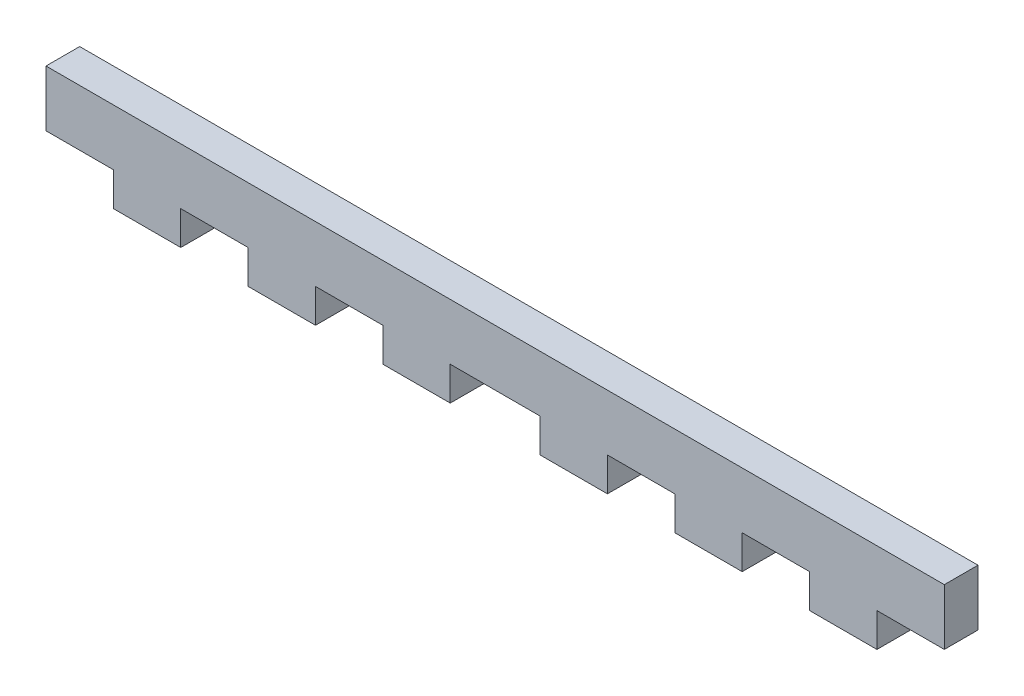
ISO-10303-21;
HEADER;
FILE_DESCRIPTION(('STEP AP214'),'2;1');
FILE_NAME('part.step','',(''),(''),'','','');
FILE_SCHEMA(('AUTOMOTIVE_DESIGN { 1 0 10303 214 1 1 1 1 }'));
ENDSEC;
DATA;
#1=APPLICATION_CONTEXT('core data for automotive mechanical design processes');
#2=APPLICATION_PROTOCOL_DEFINITION('international standard','automotive_design',2000,#1);
#3=PRODUCT_CONTEXT('',#1,'mechanical');
#4=PRODUCT('Part','Part','',(#3));
#5=PRODUCT_RELATED_PRODUCT_CATEGORY('part','',(#4));
#6=PRODUCT_DEFINITION_FORMATION('','',#4);
#7=PRODUCT_DEFINITION_CONTEXT('part definition',#1,'design');
#8=PRODUCT_DEFINITION('design','',#6,#7);
#9=PRODUCT_DEFINITION_SHAPE('','',#8);
#10=(LENGTH_UNIT() NAMED_UNIT(*) SI_UNIT(.MILLI.,.METRE.));
#11=(NAMED_UNIT(*) PLANE_ANGLE_UNIT() SI_UNIT($,.RADIAN.));
#12=(NAMED_UNIT(*) SI_UNIT($,.STERADIAN.) SOLID_ANGLE_UNIT());
#13=UNCERTAINTY_MEASURE_WITH_UNIT(LENGTH_MEASURE(1.E-05),#10,'distance_accuracy_value','');
#14=(GEOMETRIC_REPRESENTATION_CONTEXT(3) GLOBAL_UNCERTAINTY_ASSIGNED_CONTEXT((#13)) GLOBAL_UNIT_ASSIGNED_CONTEXT((#10,
#11,#12)) REPRESENTATION_CONTEXT('',''));
#15=CARTESIAN_POINT('',(0.,0.,0.));
#16=DIRECTION('',(0.,0.,1.));
#17=DIRECTION('',(1.,0.,0.));
#18=AXIS2_PLACEMENT_3D('',#15,#16,#17);
#19=CARTESIAN_POINT('',(-33.3200921356,-10.7316898359705,3.));
#20=DIRECTION('',(0.,1.,0.));
#21=DIRECTION('',(0.,0.,1.));
#22=AXIS2_PLACEMENT_3D('',#19,#20,#21);
#23=PLANE('',#22);
#24=DIRECTION('',(0.,0.,1.));
#25=VECTOR('',#24,1.);
#26=CARTESIAN_POINT('',(40.6799078644,-10.7316898359705,0.));
#27=LINE('',#26,#25);
#28=CARTESIAN_POINT('',(40.6799078644,-10.7316898359705,0.));
#29=VERTEX_POINT('',#28);
#30=CARTESIAN_POINT('',(40.6799078644,-10.7316898359705,3.));
#31=VERTEX_POINT('',#30);
#32=EDGE_CURVE('E332',#29,#31,#27,.T.);
#33=ORIENTED_EDGE('',*,*,#32,.F.);
#34=DIRECTION('',(1.,0.,0.));
#35=VECTOR('',#34,1.);
#36=CARTESIAN_POINT('',(-33.3200921356,-10.7316898359705,0.));
#37=LINE('',#36,#35);
#38=CARTESIAN_POINT('',(46.6799078644,-10.7316898359705,0.));
#39=VERTEX_POINT('',#38);
#40=EDGE_CURVE('E259',#29,#39,#37,.T.);
#41=ORIENTED_EDGE('',*,*,#40,.T.);
#42=DIRECTION('',(0.,0.,-1.));
#43=VECTOR('',#42,1.);
#44=CARTESIAN_POINT('',(46.6799078644,-10.7316898359705,3.));
#45=LINE('',#44,#43);
#46=CARTESIAN_POINT('',(46.6799078644,-10.7316898359705,3.));
#47=VERTEX_POINT('',#46);
#48=EDGE_CURVE('E54',#47,#39,#45,.T.);
#49=ORIENTED_EDGE('',*,*,#48,.F.);
#50=DIRECTION('',(1.,0.,0.));
#51=VECTOR('',#50,1.);
#52=CARTESIAN_POINT('',(-33.3200921356,-10.7316898359705,3.));
#53=LINE('',#52,#51);
#54=EDGE_CURVE('E313',#31,#47,#53,.T.);
#55=ORIENTED_EDGE('',*,*,#54,.F.);
#56=EDGE_LOOP('',(#33,#41,#49,#55));
#57=FACE_BOUND('',#56,.T.);
#58=ADVANCED_FACE('F45',(#57),#23,.F.);
#59=CARTESIAN_POINT('',(28.6799078644001,-10.7316898359705,0.));
#60=VERTEX_POINT('',#59);
#61=CARTESIAN_POINT('',(34.6799078644001,-10.7316898359705,0.));
#62=VERTEX_POINT('',#61);
#63=EDGE_CURVE('E247',#60,#62,#37,.T.);
#64=ORIENTED_EDGE('',*,*,#63,.T.);
#65=DIRECTION('',(0.,0.,1.));
#66=VECTOR('',#65,1.);
#67=CARTESIAN_POINT('',(34.6799078644001,-10.7316898359705,0.));
#68=LINE('',#67,#66);
#69=CARTESIAN_POINT('',(34.6799078644001,-10.7316898359705,3.));
#70=VERTEX_POINT('',#69);
#71=EDGE_CURVE('E229',#62,#70,#68,.T.);
#72=ORIENTED_EDGE('',*,*,#71,.T.);
#73=CARTESIAN_POINT('',(28.6799078644001,-10.7316898359705,3.));
#74=VERTEX_POINT('',#73);
#75=EDGE_CURVE('E316',#74,#70,#53,.T.);
#76=ORIENTED_EDGE('',*,*,#75,.F.);
#77=DIRECTION('',(0.,0.,1.));
#78=VECTOR('',#77,1.);
#79=CARTESIAN_POINT('',(28.6799078644001,-10.7316898359705,0.));
#80=LINE('',#79,#78);
#81=EDGE_CURVE('E256',#60,#74,#80,.T.);
#82=ORIENTED_EDGE('',*,*,#81,.F.);
#83=EDGE_LOOP('',(#64,#72,#76,#82));
#84=FACE_BOUND('',#83,.T.);
#85=ADVANCED_FACE('F255',(#84),#23,.F.);
#86=CARTESIAN_POINT('',(16.6799078644,-10.7316898359705,0.));
#87=VERTEX_POINT('',#86);
#88=CARTESIAN_POINT('',(22.6799078644,-10.7316898359705,0.));
#89=VERTEX_POINT('',#88);
#90=EDGE_CURVE('E258',#87,#89,#37,.T.);
#91=ORIENTED_EDGE('',*,*,#90,.T.);
#92=DIRECTION('',(0.,0.,1.));
#93=VECTOR('',#92,1.);
#94=CARTESIAN_POINT('',(22.6799078644,-10.7316898359705,0.));
#95=LINE('',#94,#93);
#96=CARTESIAN_POINT('',(22.6799078644,-10.7316898359705,3.));
#97=VERTEX_POINT('',#96);
#98=EDGE_CURVE('E345',#89,#97,#95,.T.);
#99=ORIENTED_EDGE('',*,*,#98,.T.);
#100=CARTESIAN_POINT('',(16.6799078644,-10.7316898359705,3.));
#101=VERTEX_POINT('',#100);
#102=EDGE_CURVE('E561',#101,#97,#53,.T.);
#103=ORIENTED_EDGE('',*,*,#102,.F.);
#104=DIRECTION('',(0.,0.,1.));
#105=VECTOR('',#104,1.);
#106=CARTESIAN_POINT('',(16.6799078644,-10.7316898359705,0.));
#107=LINE('',#106,#105);
#108=EDGE_CURVE('E389',#87,#101,#107,.T.);
#109=ORIENTED_EDGE('',*,*,#108,.F.);
#110=EDGE_LOOP('',(#91,#99,#103,#109));
#111=FACE_BOUND('',#110,.T.);
#112=ADVANCED_FACE('F578',(#111),#23,.F.);
#113=CARTESIAN_POINT('',(2.67990786440001,-10.7316898359705,0.));
#114=VERTEX_POINT('',#113);
#115=CARTESIAN_POINT('',(10.6799078644001,-10.7316898359705,0.));
#116=VERTEX_POINT('',#115);
#117=EDGE_CURVE('E264',#114,#116,#37,.T.);
#118=ORIENTED_EDGE('',*,*,#117,.T.);
#119=DIRECTION('',(0.,0.,1.));
#120=VECTOR('',#119,1.);
#121=CARTESIAN_POINT('',(10.6799078644001,-10.7316898359705,0.));
#122=LINE('',#121,#120);
#123=CARTESIAN_POINT('',(10.6799078644001,-10.7316898359705,3.));
#124=VERTEX_POINT('',#123);
#125=EDGE_CURVE('E378',#116,#124,#122,.T.);
#126=ORIENTED_EDGE('',*,*,#125,.T.);
#127=CARTESIAN_POINT('',(2.67990786440001,-10.7316898359705,3.));
#128=VERTEX_POINT('',#127);
#129=EDGE_CURVE('E557',#128,#124,#53,.T.);
#130=ORIENTED_EDGE('',*,*,#129,.F.);
#131=DIRECTION('',(0.,0.,1.));
#132=VECTOR('',#131,1.);
#133=CARTESIAN_POINT('',(2.67990786440001,-10.7316898359705,0.));
#134=LINE('',#133,#132);
#135=EDGE_CURVE('E414',#114,#128,#134,.T.);
#136=ORIENTED_EDGE('',*,*,#135,.F.);
#137=EDGE_LOOP('',(#118,#126,#130,#136));
#138=FACE_BOUND('',#137,.T.);
#139=ADVANCED_FACE('F545',(#138),#23,.F.);
#140=CARTESIAN_POINT('',(-9.32009213559996,-10.7316898359705,0.));
#141=VERTEX_POINT('',#140);
#142=CARTESIAN_POINT('',(-3.32009213559996,-10.7316898359705,0.));
#143=VERTEX_POINT('',#142);
#144=EDGE_CURVE('E534',#141,#143,#37,.T.);
#145=ORIENTED_EDGE('',*,*,#144,.T.);
#146=DIRECTION('',(0.,0.,1.));
#147=VECTOR('',#146,1.);
#148=CARTESIAN_POINT('',(-3.32009213559996,-10.7316898359705,0.));
#149=LINE('',#148,#147);
#150=CARTESIAN_POINT('',(-3.32009213559996,-10.7316898359705,3.));
#151=VERTEX_POINT('',#150);
#152=EDGE_CURVE('E418',#143,#151,#149,.T.);
#153=ORIENTED_EDGE('',*,*,#152,.T.);
#154=CARTESIAN_POINT('',(-9.32009213559996,-10.7316898359705,3.));
#155=VERTEX_POINT('',#154);
#156=EDGE_CURVE('E560',#155,#151,#53,.T.);
#157=ORIENTED_EDGE('',*,*,#156,.F.);
#158=DIRECTION('',(0.,0.,1.));
#159=VECTOR('',#158,1.);
#160=CARTESIAN_POINT('',(-9.32009213559996,-10.7316898359705,0.));
#161=LINE('',#160,#159);
#162=EDGE_CURVE('E450',#141,#155,#161,.T.);
#163=ORIENTED_EDGE('',*,*,#162,.F.);
#164=EDGE_LOOP('',(#145,#153,#157,#163));
#165=FACE_BOUND('',#164,.T.);
#166=ADVANCED_FACE('F608',(#165),#23,.F.);
#167=CARTESIAN_POINT('',(-21.3200921356,-10.7316898359705,0.));
#168=VERTEX_POINT('',#167);
#169=CARTESIAN_POINT('',(-15.3200921356,-10.7316898359705,0.));
#170=VERTEX_POINT('',#169);
#171=EDGE_CURVE('E272',#168,#170,#37,.T.);
#172=ORIENTED_EDGE('',*,*,#171,.T.);
#173=DIRECTION('',(0.,0.,1.));
#174=VECTOR('',#173,1.);
#175=CARTESIAN_POINT('',(-15.3200921356,-10.7316898359705,0.));
#176=LINE('',#175,#174);
#177=CARTESIAN_POINT('',(-15.3200921356,-10.7316898359705,3.));
#178=VERTEX_POINT('',#177);
#179=EDGE_CURVE('E454',#170,#178,#176,.T.);
#180=ORIENTED_EDGE('',*,*,#179,.T.);
#181=CARTESIAN_POINT('',(-21.3200921356,-10.7316898359705,3.));
#182=VERTEX_POINT('',#181);
#183=EDGE_CURVE('E324',#182,#178,#53,.T.);
#184=ORIENTED_EDGE('',*,*,#183,.F.);
#185=DIRECTION('',(0.,0.,1.));
#186=VECTOR('',#185,1.);
#187=CARTESIAN_POINT('',(-21.3200921356,-10.7316898359705,0.));
#188=LINE('',#187,#186);
#189=EDGE_CURVE('E486',#168,#182,#188,.T.);
#190=ORIENTED_EDGE('',*,*,#189,.F.);
#191=EDGE_LOOP('',(#172,#180,#184,#190));
#192=FACE_BOUND('',#191,.T.);
#193=ADVANCED_FACE('F529',(#192),#23,.F.);
#194=CARTESIAN_POINT('',(-33.3200921356,-10.7316898359705,3.));
#195=DIRECTION('',(1.,0.,0.));
#196=DIRECTION('',(0.,0.,-1.));
#197=AXIS2_PLACEMENT_3D('',#194,#195,#196);
#198=PLANE('',#197);
#199=DIRECTION('',(0.,-1.,0.));
#200=VECTOR('',#199,1.);
#201=CARTESIAN_POINT('',(-33.3200921356,-10.7316898359705,0.));
#202=LINE('',#201,#200);
#203=CARTESIAN_POINT('',(-33.3200921356,-5.73168983597051,0.));
#204=VERTEX_POINT('',#203);
#205=CARTESIAN_POINT('',(-33.3200921356,-10.7316898359705,0.));
#206=VERTEX_POINT('',#205);
#207=EDGE_CURVE('E265',#204,#206,#202,.T.);
#208=ORIENTED_EDGE('',*,*,#207,.T.);
#209=DIRECTION('',(0.,0.,-1.));
#210=VECTOR('',#209,1.);
#211=CARTESIAN_POINT('',(-33.3200921356,-10.7316898359705,3.));
#212=LINE('',#211,#210);
#213=CARTESIAN_POINT('',(-33.3200921356,-10.7316898359705,3.));
#214=VERTEX_POINT('',#213);
#215=EDGE_CURVE('E11',#214,#206,#212,.T.);
#216=ORIENTED_EDGE('',*,*,#215,.F.);
#217=DIRECTION('',(0.,-1.,0.));
#218=VECTOR('',#217,1.);
#219=CARTESIAN_POINT('',(-33.3200921356,-10.7316898359705,3.));
#220=LINE('',#219,#218);
#221=CARTESIAN_POINT('',(-33.3200921356,-5.73168983597051,3.));
#222=VERTEX_POINT('',#221);
#223=EDGE_CURVE('E279',#222,#214,#220,.T.);
#224=ORIENTED_EDGE('',*,*,#223,.F.);
#225=DIRECTION('',(0.,0.,-1.));
#226=VECTOR('',#225,1.);
#227=CARTESIAN_POINT('',(-33.3200921356,-5.73168983597051,3.));
#228=LINE('',#227,#226);
#229=EDGE_CURVE('E280',#222,#204,#228,.T.);
#230=ORIENTED_EDGE('',*,*,#229,.T.);
#231=EDGE_LOOP('',(#208,#216,#224,#230));
#232=FACE_BOUND('',#231,.T.);
#233=ADVANCED_FACE('F47',(#232),#198,.F.);
#234=CARTESIAN_POINT('',(-27.3200921356,-10.7316898359705,0.));
#235=VERTEX_POINT('',#234);
#236=EDGE_CURVE('E266',#206,#235,#37,.T.);
#237=ORIENTED_EDGE('',*,*,#236,.T.);
#238=DIRECTION('',(0.,0.,1.));
#239=VECTOR('',#238,1.);
#240=CARTESIAN_POINT('',(-27.3200921356,-10.7316898359705,0.));
#241=LINE('',#240,#239);
#242=CARTESIAN_POINT('',(-27.3200921356,-10.7316898359705,3.));
#243=VERTEX_POINT('',#242);
#244=EDGE_CURVE('E490',#235,#243,#241,.T.);
#245=ORIENTED_EDGE('',*,*,#244,.T.);
#246=EDGE_CURVE('E318',#214,#243,#53,.T.);
#247=ORIENTED_EDGE('',*,*,#246,.F.);
#248=ORIENTED_EDGE('',*,*,#215,.T.);
#249=EDGE_LOOP('',(#237,#245,#247,#248));
#250=FACE_BOUND('',#249,.T.);
#251=ADVANCED_FACE('F594',(#250),#23,.F.);
#252=CARTESIAN_POINT('',(46.6799078644,-10.7316898359705,3.));
#253=DIRECTION('',(-1.,0.,0.));
#254=DIRECTION('',(0.,0.,1.));
#255=AXIS2_PLACEMENT_3D('',#252,#253,#254);
#256=PLANE('',#255);
#257=DIRECTION('',(0.,1.,0.));
#258=VECTOR('',#257,1.);
#259=CARTESIAN_POINT('',(46.6799078644,-10.7316898359705,0.));
#260=LINE('',#259,#258);
#261=CARTESIAN_POINT('',(46.6799078644,-5.73168983597051,0.));
#262=VERTEX_POINT('',#261);
#263=EDGE_CURVE('E271',#39,#262,#260,.T.);
#264=ORIENTED_EDGE('',*,*,#263,.T.);
#265=DIRECTION('',(0.,0.,-1.));
#266=VECTOR('',#265,1.);
#267=CARTESIAN_POINT('',(46.6799078644,-5.73168983597051,3.));
#268=LINE('',#267,#266);
#269=CARTESIAN_POINT('',(46.6799078644,-5.73168983597051,3.));
#270=VERTEX_POINT('',#269);
#271=EDGE_CURVE('E284',#270,#262,#268,.T.);
#272=ORIENTED_EDGE('',*,*,#271,.F.);
#273=DIRECTION('',(0.,1.,0.));
#274=VECTOR('',#273,1.);
#275=CARTESIAN_POINT('',(46.6799078644,-10.7316898359705,3.));
#276=LINE('',#275,#274);
#277=EDGE_CURVE('E296',#47,#270,#276,.T.);
#278=ORIENTED_EDGE('',*,*,#277,.F.);
#279=ORIENTED_EDGE('',*,*,#48,.T.);
#280=EDGE_LOOP('',(#264,#272,#278,#279));
#281=FACE_BOUND('',#280,.T.);
#282=ADVANCED_FACE('F294',(#281),#256,.F.);
#283=CARTESIAN_POINT('',(-33.3200921356,-5.73168983597051,3.));
#284=DIRECTION('',(0.,-1.,0.));
#285=DIRECTION('',(0.,0.,-1.));
#286=AXIS2_PLACEMENT_3D('',#283,#284,#285);
#287=PLANE('',#286);
#288=DIRECTION('',(-1.,0.,0.));
#289=VECTOR('',#288,1.);
#290=CARTESIAN_POINT('',(-33.3200921356,-5.73168983597051,0.));
#291=LINE('',#290,#289);
#292=EDGE_CURVE('E276',#262,#204,#291,.T.);
#293=ORIENTED_EDGE('',*,*,#292,.T.);
#294=ORIENTED_EDGE('',*,*,#229,.F.);
#295=DIRECTION('',(-1.,0.,0.));
#296=VECTOR('',#295,1.);
#297=CARTESIAN_POINT('',(-33.3200921356,-5.73168983597051,3.));
#298=LINE('',#297,#296);
#299=EDGE_CURVE('E285',#270,#222,#298,.T.);
#300=ORIENTED_EDGE('',*,*,#299,.F.);
#301=ORIENTED_EDGE('',*,*,#271,.T.);
#302=EDGE_LOOP('',(#293,#294,#300,#301));
#303=FACE_BOUND('',#302,.T.);
#304=ADVANCED_FACE('F304',(#303),#287,.F.);
#305=CARTESIAN_POINT('',(0.,0.,3.));
#306=DIRECTION('',(0.,0.,-1.));
#307=DIRECTION('',(-1.,0.,0.));
#308=AXIS2_PLACEMENT_3D('',#305,#306,#307);
#309=PLANE('',#308);
#310=ORIENTED_EDGE('',*,*,#223,.T.);
#311=ORIENTED_EDGE('',*,*,#246,.T.);
#312=DIRECTION('',(0.,-1.,0.));
#313=VECTOR('',#312,1.);
#314=CARTESIAN_POINT('',(-27.3200921356,-13.7316898359705,3.));
#315=LINE('',#314,#313);
#316=CARTESIAN_POINT('',(-27.3200921356,-13.7316898359705,3.));
#317=VERTEX_POINT('',#316);
#318=EDGE_CURVE('E504',#243,#317,#315,.T.);
#319=ORIENTED_EDGE('',*,*,#318,.T.);
#320=DIRECTION('',(1.,0.,0.));
#321=VECTOR('',#320,1.);
#322=CARTESIAN_POINT('',(-21.3200921356,-13.7316898359705,3.));
#323=LINE('',#322,#321);
#324=CARTESIAN_POINT('',(-21.3200921356,-13.7316898359705,3.));
#325=VERTEX_POINT('',#324);
#326=EDGE_CURVE('E500',#317,#325,#323,.T.);
#327=ORIENTED_EDGE('',*,*,#326,.T.);
#328=DIRECTION('',(0.,1.,0.));
#329=VECTOR('',#328,1.);
#330=CARTESIAN_POINT('',(-21.3200921356,-10.7316898359705,3.));
#331=LINE('',#330,#329);
#332=EDGE_CURVE('E464',#325,#182,#331,.T.);
#333=ORIENTED_EDGE('',*,*,#332,.T.);
#334=ORIENTED_EDGE('',*,*,#183,.T.);
#335=DIRECTION('',(0.,-1.,0.));
#336=VECTOR('',#335,1.);
#337=CARTESIAN_POINT('',(-15.3200921356,-13.7316898359705,3.));
#338=LINE('',#337,#336);
#339=CARTESIAN_POINT('',(-15.3200921356,-13.7316898359705,3.));
#340=VERTEX_POINT('',#339);
#341=EDGE_CURVE('E469',#178,#340,#338,.T.);
#342=ORIENTED_EDGE('',*,*,#341,.T.);
#343=DIRECTION('',(1.,0.,0.));
#344=VECTOR('',#343,1.);
#345=CARTESIAN_POINT('',(-9.32009213559996,-13.7316898359705,3.));
#346=LINE('',#345,#344);
#347=CARTESIAN_POINT('',(-9.32009213559996,-13.7316898359705,3.));
#348=VERTEX_POINT('',#347);
#349=EDGE_CURVE('E465',#340,#348,#346,.T.);
#350=ORIENTED_EDGE('',*,*,#349,.T.);
#351=DIRECTION('',(0.,1.,0.));
#352=VECTOR('',#351,1.);
#353=CARTESIAN_POINT('',(-9.32009213559996,-10.7316898359705,3.));
#354=LINE('',#353,#352);
#355=EDGE_CURVE('E428',#348,#155,#354,.T.);
#356=ORIENTED_EDGE('',*,*,#355,.T.);
#357=ORIENTED_EDGE('',*,*,#156,.T.);
#358=DIRECTION('',(0.,-1.,0.));
#359=VECTOR('',#358,1.);
#360=CARTESIAN_POINT('',(-3.32009213559996,-13.7316898359705,3.));
#361=LINE('',#360,#359);
#362=CARTESIAN_POINT('',(-3.32009213559996,-13.7316898359705,3.));
#363=VERTEX_POINT('',#362);
#364=EDGE_CURVE('E433',#151,#363,#361,.T.);
#365=ORIENTED_EDGE('',*,*,#364,.T.);
#366=DIRECTION('',(1.,0.,0.));
#367=VECTOR('',#366,1.);
#368=CARTESIAN_POINT('',(2.67990786440002,-13.7316898359705,3.));
#369=LINE('',#368,#367);
#370=CARTESIAN_POINT('',(2.67990786440002,-13.7316898359705,3.));
#371=VERTEX_POINT('',#370);
#372=EDGE_CURVE('E429',#363,#371,#369,.T.);
#373=ORIENTED_EDGE('',*,*,#372,.T.);
#374=DIRECTION('',(0.,1.,0.));
#375=VECTOR('',#374,1.);
#376=CARTESIAN_POINT('',(2.67990786440001,-10.7316898359705,3.));
#377=LINE('',#376,#375);
#378=EDGE_CURVE('E392',#371,#128,#377,.T.);
#379=ORIENTED_EDGE('',*,*,#378,.T.);
#380=ORIENTED_EDGE('',*,*,#129,.T.);
#381=DIRECTION('',(0.,-1.,0.));
#382=VECTOR('',#381,1.);
#383=CARTESIAN_POINT('',(10.6799078644001,-13.7316898359705,3.));
#384=LINE('',#383,#382);
#385=CARTESIAN_POINT('',(10.6799078644001,-13.7316898359705,3.));
#386=VERTEX_POINT('',#385);
#387=EDGE_CURVE('E357',#124,#386,#384,.T.);
#388=ORIENTED_EDGE('',*,*,#387,.T.);
#389=DIRECTION('',(1.,0.,0.));
#390=VECTOR('',#389,1.);
#391=CARTESIAN_POINT('',(16.6799078644,-13.7316898359705,3.));
#392=LINE('',#391,#390);
#393=CARTESIAN_POINT('',(16.6799078644,-13.7316898359705,3.));
#394=VERTEX_POINT('',#393);
#395=EDGE_CURVE('E397',#386,#394,#392,.T.);
#396=ORIENTED_EDGE('',*,*,#395,.T.);
#397=DIRECTION('',(0.,1.,0.));
#398=VECTOR('',#397,1.);
#399=CARTESIAN_POINT('',(16.6799078644,-10.7316898359705,3.));
#400=LINE('',#399,#398);
#401=EDGE_CURVE('E393',#394,#101,#400,.T.);
#402=ORIENTED_EDGE('',*,*,#401,.T.);
#403=ORIENTED_EDGE('',*,*,#102,.T.);
#404=DIRECTION('',(0.,-1.,0.));
#405=VECTOR('',#404,1.);
#406=CARTESIAN_POINT('',(22.6799078644,-13.7316898359705,3.));
#407=LINE('',#406,#405);
#408=CARTESIAN_POINT('',(22.6799078644,-13.7316898359705,3.));
#409=VERTEX_POINT('',#408);
#410=EDGE_CURVE('E69',#97,#409,#407,.T.);
#411=ORIENTED_EDGE('',*,*,#410,.T.);
#412=DIRECTION('',(1.,0.,0.));
#413=VECTOR('',#412,1.);
#414=CARTESIAN_POINT('',(28.6799078644001,-13.7316898359705,3.));
#415=LINE('',#414,#413);
#416=CARTESIAN_POINT('',(28.6799078644001,-13.7316898359705,3.));
#417=VERTEX_POINT('',#416);
#418=EDGE_CURVE('E362',#409,#417,#415,.T.);
#419=ORIENTED_EDGE('',*,*,#418,.T.);
#420=DIRECTION('',(0.,1.,0.));
#421=VECTOR('',#420,1.);
#422=CARTESIAN_POINT('',(28.6799078644001,-10.7316898359705,3.));
#423=LINE('',#422,#421);
#424=EDGE_CURVE('E358',#417,#74,#423,.T.);
#425=ORIENTED_EDGE('',*,*,#424,.T.);
#426=ORIENTED_EDGE('',*,*,#75,.T.);
#427=DIRECTION('',(0.,-1.,0.));
#428=VECTOR('',#427,1.);
#429=CARTESIAN_POINT('',(34.6799078644001,-13.7316898359705,3.));
#430=LINE('',#429,#428);
#431=CARTESIAN_POINT('',(34.6799078644001,-13.7316898359705,3.));
#432=VERTEX_POINT('',#431);
#433=EDGE_CURVE('E61',#70,#432,#430,.T.);
#434=ORIENTED_EDGE('',*,*,#433,.T.);
#435=DIRECTION('',(1.,0.,0.));
#436=VECTOR('',#435,1.);
#437=CARTESIAN_POINT('',(40.6799078644,-13.7316898359705,3.));
#438=LINE('',#437,#436);
#439=CARTESIAN_POINT('',(40.6799078644,-13.7316898359705,3.));
#440=VERTEX_POINT('',#439);
#441=EDGE_CURVE('E838',#432,#440,#438,.T.);
#442=ORIENTED_EDGE('',*,*,#441,.T.);
#443=DIRECTION('',(0.,1.,0.));
#444=VECTOR('',#443,1.);
#445=CARTESIAN_POINT('',(40.6799078644,-10.7316898359705,3.));
#446=LINE('',#445,#444);
#447=EDGE_CURVE('E252',#440,#31,#446,.T.);
#448=ORIENTED_EDGE('',*,*,#447,.T.);
#449=ORIENTED_EDGE('',*,*,#54,.T.);
#450=ORIENTED_EDGE('',*,*,#277,.T.);
#451=ORIENTED_EDGE('',*,*,#299,.T.);
#452=EDGE_LOOP('',(#310,#311,#319,#327,#333,#334,#342,#350,#356,#357,#365,#373,#379,#380,#388,
#396,#402,#403,#411,#419,#425,#426,#434,#442,#448,#449,#450,#451));
#453=FACE_BOUND('',#452,.T.);
#454=ADVANCED_FACE('F327',(#453),#309,.F.);
#455=CARTESIAN_POINT('',(0.,0.,0.));
#456=DIRECTION('',(0.,0.,-1.));
#457=DIRECTION('',(-1.,0.,0.));
#458=AXIS2_PLACEMENT_3D('',#455,#456,#457);
#459=PLANE('',#458);
#460=ORIENTED_EDGE('',*,*,#207,.F.);
#461=ORIENTED_EDGE('',*,*,#292,.F.);
#462=ORIENTED_EDGE('',*,*,#263,.F.);
#463=ORIENTED_EDGE('',*,*,#40,.F.);
#464=DIRECTION('',(0.,1.,0.));
#465=VECTOR('',#464,1.);
#466=CARTESIAN_POINT('',(40.6799078644,-10.7316898359705,0.));
#467=LINE('',#466,#465);
#468=CARTESIAN_POINT('',(40.6799078644,-13.7316898359705,0.));
#469=VERTEX_POINT('',#468);
#470=EDGE_CURVE('E239',#469,#29,#467,.T.);
#471=ORIENTED_EDGE('',*,*,#470,.F.);
#472=DIRECTION('',(1.,0.,0.));
#473=VECTOR('',#472,1.);
#474=CARTESIAN_POINT('',(40.6799078644,-13.7316898359705,0.));
#475=LINE('',#474,#473);
#476=CARTESIAN_POINT('',(34.6799078644001,-13.7316898359705,0.));
#477=VERTEX_POINT('',#476);
#478=EDGE_CURVE('E250',#477,#469,#475,.T.);
#479=ORIENTED_EDGE('',*,*,#478,.F.);
#480=DIRECTION('',(0.,-1.,0.));
#481=VECTOR('',#480,1.);
#482=CARTESIAN_POINT('',(34.6799078644001,-13.7316898359705,0.));
#483=LINE('',#482,#481);
#484=EDGE_CURVE('E232',#62,#477,#483,.T.);
#485=ORIENTED_EDGE('',*,*,#484,.F.);
#486=ORIENTED_EDGE('',*,*,#63,.F.);
#487=DIRECTION('',(0.,1.,0.));
#488=VECTOR('',#487,1.);
#489=CARTESIAN_POINT('',(28.6799078644001,-10.7316898359705,0.));
#490=LINE('',#489,#488);
#491=CARTESIAN_POINT('',(28.6799078644001,-13.7316898359705,0.));
#492=VERTEX_POINT('',#491);
#493=EDGE_CURVE('E348',#492,#60,#490,.T.);
#494=ORIENTED_EDGE('',*,*,#493,.F.);
#495=DIRECTION('',(1.,0.,0.));
#496=VECTOR('',#495,1.);
#497=CARTESIAN_POINT('',(28.6799078644001,-13.7316898359705,0.));
#498=LINE('',#497,#496);
#499=CARTESIAN_POINT('',(22.6799078644,-13.7316898359705,0.));
#500=VERTEX_POINT('',#499);
#501=EDGE_CURVE('E371',#500,#492,#498,.T.);
#502=ORIENTED_EDGE('',*,*,#501,.F.);
#503=DIRECTION('',(0.,-1.,0.));
#504=VECTOR('',#503,1.);
#505=CARTESIAN_POINT('',(22.6799078644,-13.7316898359705,0.));
#506=LINE('',#505,#504);
#507=EDGE_CURVE('E363',#89,#500,#506,.T.);
#508=ORIENTED_EDGE('',*,*,#507,.F.);
#509=ORIENTED_EDGE('',*,*,#90,.F.);
#510=DIRECTION('',(0.,1.,0.));
#511=VECTOR('',#510,1.);
#512=CARTESIAN_POINT('',(16.6799078644,-10.7316898359705,0.));
#513=LINE('',#512,#511);
#514=CARTESIAN_POINT('',(16.6799078644,-13.7316898359705,0.));
#515=VERTEX_POINT('',#514);
#516=EDGE_CURVE('E382',#515,#87,#513,.T.);
#517=ORIENTED_EDGE('',*,*,#516,.F.);
#518=DIRECTION('',(1.,0.,0.));
#519=VECTOR('',#518,1.);
#520=CARTESIAN_POINT('',(16.6799078644,-13.7316898359705,0.));
#521=LINE('',#520,#519);
#522=CARTESIAN_POINT('',(10.6799078644001,-13.7316898359705,0.));
#523=VERTEX_POINT('',#522);
#524=EDGE_CURVE('E407',#523,#515,#521,.T.);
#525=ORIENTED_EDGE('',*,*,#524,.F.);
#526=DIRECTION('',(0.,-1.,0.));
#527=VECTOR('',#526,1.);
#528=CARTESIAN_POINT('',(10.6799078644001,-13.7316898359705,0.));
#529=LINE('',#528,#527);
#530=EDGE_CURVE('E398',#116,#523,#529,.T.);
#531=ORIENTED_EDGE('',*,*,#530,.F.);
#532=ORIENTED_EDGE('',*,*,#117,.F.);
#533=DIRECTION('',(0.,1.,0.));
#534=VECTOR('',#533,1.);
#535=CARTESIAN_POINT('',(2.67990786440001,-10.7316898359705,0.));
#536=LINE('',#535,#534);
#537=CARTESIAN_POINT('',(2.67990786440002,-13.7316898359705,0.));
#538=VERTEX_POINT('',#537);
#539=EDGE_CURVE('E434',#538,#114,#536,.T.);
#540=ORIENTED_EDGE('',*,*,#539,.F.);
#541=DIRECTION('',(1.,0.,0.));
#542=VECTOR('',#541,1.);
#543=CARTESIAN_POINT('',(2.67990786440002,-13.7316898359705,0.));
#544=LINE('',#543,#542);
#545=CARTESIAN_POINT('',(-3.32009213559996,-13.7316898359705,0.));
#546=VERTEX_POINT('',#545);
#547=EDGE_CURVE('E417',#546,#538,#544,.T.);
#548=ORIENTED_EDGE('',*,*,#547,.F.);
#549=DIRECTION('',(0.,-1.,0.));
#550=VECTOR('',#549,1.);
#551=CARTESIAN_POINT('',(-3.32009213559996,-13.7316898359705,0.));
#552=LINE('',#551,#550);
#553=EDGE_CURVE('E444',#143,#546,#552,.T.);
#554=ORIENTED_EDGE('',*,*,#553,.F.);
#555=ORIENTED_EDGE('',*,*,#144,.F.);
#556=DIRECTION('',(0.,1.,0.));
#557=VECTOR('',#556,1.);
#558=CARTESIAN_POINT('',(-9.32009213559996,-10.7316898359705,0.));
#559=LINE('',#558,#557);
#560=CARTESIAN_POINT('',(-9.32009213559996,-13.7316898359705,0.));
#561=VERTEX_POINT('',#560);
#562=EDGE_CURVE('E470',#561,#141,#559,.T.);
#563=ORIENTED_EDGE('',*,*,#562,.F.);
#564=DIRECTION('',(1.,0.,0.));
#565=VECTOR('',#564,1.);
#566=CARTESIAN_POINT('',(-9.32009213559996,-13.7316898359705,0.));
#567=LINE('',#566,#565);
#568=CARTESIAN_POINT('',(-15.3200921356,-13.7316898359705,0.));
#569=VERTEX_POINT('',#568);
#570=EDGE_CURVE('E453',#569,#561,#567,.T.);
#571=ORIENTED_EDGE('',*,*,#570,.F.);
#572=DIRECTION('',(0.,-1.,0.));
#573=VECTOR('',#572,1.);
#574=CARTESIAN_POINT('',(-15.3200921356,-13.7316898359705,0.));
#575=LINE('',#574,#573);
#576=EDGE_CURVE('E480',#170,#569,#575,.T.);
#577=ORIENTED_EDGE('',*,*,#576,.F.);
#578=ORIENTED_EDGE('',*,*,#171,.F.);
#579=DIRECTION('',(0.,1.,0.));
#580=VECTOR('',#579,1.);
#581=CARTESIAN_POINT('',(-21.3200921356,-10.7316898359705,0.));
#582=LINE('',#581,#580);
#583=CARTESIAN_POINT('',(-21.3200921356,-13.7316898359705,0.));
#584=VERTEX_POINT('',#583);
#585=EDGE_CURVE('E320',#584,#168,#582,.T.);
#586=ORIENTED_EDGE('',*,*,#585,.F.);
#587=DIRECTION('',(1.,0.,0.));
#588=VECTOR('',#587,1.);
#589=CARTESIAN_POINT('',(-21.3200921356,-13.7316898359705,0.));
#590=LINE('',#589,#588);
#591=CARTESIAN_POINT('',(-27.3200921356,-13.7316898359705,0.));
#592=VERTEX_POINT('',#591);
#593=EDGE_CURVE('E489',#592,#584,#590,.T.);
#594=ORIENTED_EDGE('',*,*,#593,.F.);
#595=DIRECTION('',(0.,-1.,0.));
#596=VECTOR('',#595,1.);
#597=CARTESIAN_POINT('',(-27.3200921356,-13.7316898359705,0.));
#598=LINE('',#597,#596);
#599=EDGE_CURVE('E513',#235,#592,#598,.T.);
#600=ORIENTED_EDGE('',*,*,#599,.F.);
#601=ORIENTED_EDGE('',*,*,#236,.F.);
#602=EDGE_LOOP('',(#460,#461,#462,#463,#471,#479,#485,#486,#494,#502,#508,#509,#517,#525,#531,
#532,#540,#548,#554,#555,#563,#571,#577,#578,#586,#594,#600,#601));
#603=FACE_BOUND('',#602,.T.);
#604=ADVANCED_FACE('F245',(#603),#459,.T.);
#605=CARTESIAN_POINT('',(-21.3200921356,-10.7316898359705,0.));
#606=DIRECTION('',(1.,0.,0.));
#607=DIRECTION('',(0.,0.,-1.));
#608=AXIS2_PLACEMENT_3D('',#605,#606,#607);
#609=PLANE('',#608);
#610=ORIENTED_EDGE('',*,*,#332,.F.);
#611=DIRECTION('',(0.,0.,1.));
#612=VECTOR('',#611,1.);
#613=CARTESIAN_POINT('',(-21.3200921356,-13.7316898359705,0.));
#614=LINE('',#613,#612);
#615=EDGE_CURVE('E497',#584,#325,#614,.T.);
#616=ORIENTED_EDGE('',*,*,#615,.F.);
#617=ORIENTED_EDGE('',*,*,#585,.T.);
#618=ORIENTED_EDGE('',*,*,#189,.T.);
#619=EDGE_LOOP('',(#610,#616,#617,#618));
#620=FACE_BOUND('',#619,.T.);
#621=ADVANCED_FACE('F524',(#620),#609,.T.);
#622=CARTESIAN_POINT('',(-21.3200921356,-13.7316898359705,0.));
#623=DIRECTION('',(0.,-1.,0.));
#624=DIRECTION('',(0.,0.,-1.));
#625=AXIS2_PLACEMENT_3D('',#622,#623,#624);
#626=PLANE('',#625);
#627=ORIENTED_EDGE('',*,*,#326,.F.);
#628=DIRECTION('',(0.,0.,1.));
#629=VECTOR('',#628,1.);
#630=CARTESIAN_POINT('',(-27.3200921356,-13.7316898359705,0.));
#631=LINE('',#630,#629);
#632=EDGE_CURVE('E494',#592,#317,#631,.T.);
#633=ORIENTED_EDGE('',*,*,#632,.F.);
#634=ORIENTED_EDGE('',*,*,#593,.T.);
#635=ORIENTED_EDGE('',*,*,#615,.T.);
#636=EDGE_LOOP('',(#627,#633,#634,#635));
#637=FACE_BOUND('',#636,.T.);
#638=ADVANCED_FACE('F689',(#637),#626,.T.);
#639=CARTESIAN_POINT('',(-27.3200921356,-13.7316898359705,0.));
#640=DIRECTION('',(-1.,0.,0.));
#641=DIRECTION('',(0.,0.,1.));
#642=AXIS2_PLACEMENT_3D('',#639,#640,#641);
#643=PLANE('',#642);
#644=ORIENTED_EDGE('',*,*,#318,.F.);
#645=ORIENTED_EDGE('',*,*,#244,.F.);
#646=ORIENTED_EDGE('',*,*,#599,.T.);
#647=ORIENTED_EDGE('',*,*,#632,.T.);
#648=EDGE_LOOP('',(#644,#645,#646,#647));
#649=FACE_BOUND('',#648,.T.);
#650=ADVANCED_FACE('F698',(#649),#643,.T.);
#651=CARTESIAN_POINT('',(-9.32009213559996,-10.7316898359705,0.));
#652=DIRECTION('',(1.,0.,0.));
#653=DIRECTION('',(0.,0.,-1.));
#654=AXIS2_PLACEMENT_3D('',#651,#652,#653);
#655=PLANE('',#654);
#656=ORIENTED_EDGE('',*,*,#355,.F.);
#657=DIRECTION('',(0.,0.,1.));
#658=VECTOR('',#657,1.);
#659=CARTESIAN_POINT('',(-9.32009213559996,-13.7316898359705,0.));
#660=LINE('',#659,#658);
#661=EDGE_CURVE('E461',#561,#348,#660,.T.);
#662=ORIENTED_EDGE('',*,*,#661,.F.);
#663=ORIENTED_EDGE('',*,*,#562,.T.);
#664=ORIENTED_EDGE('',*,*,#162,.T.);
#665=EDGE_LOOP('',(#656,#662,#663,#664));
#666=FACE_BOUND('',#665,.T.);
#667=ADVANCED_FACE('F708',(#666),#655,.T.);
#668=CARTESIAN_POINT('',(-9.32009213559996,-13.7316898359705,0.));
#669=DIRECTION('',(0.,-1.,0.));
#670=DIRECTION('',(0.,0.,-1.));
#671=AXIS2_PLACEMENT_3D('',#668,#669,#670);
#672=PLANE('',#671);
#673=ORIENTED_EDGE('',*,*,#349,.F.);
#674=DIRECTION('',(0.,0.,1.));
#675=VECTOR('',#674,1.);
#676=CARTESIAN_POINT('',(-15.3200921356,-13.7316898359705,0.));
#677=LINE('',#676,#675);
#678=EDGE_CURVE('E458',#569,#340,#677,.T.);
#679=ORIENTED_EDGE('',*,*,#678,.F.);
#680=ORIENTED_EDGE('',*,*,#570,.T.);
#681=ORIENTED_EDGE('',*,*,#661,.T.);
#682=EDGE_LOOP('',(#673,#679,#680,#681));
#683=FACE_BOUND('',#682,.T.);
#684=ADVANCED_FACE('F717',(#683),#672,.T.);
#685=CARTESIAN_POINT('',(-15.3200921356,-13.7316898359705,0.));
#686=DIRECTION('',(-1.,0.,0.));
#687=DIRECTION('',(0.,0.,1.));
#688=AXIS2_PLACEMENT_3D('',#685,#686,#687);
#689=PLANE('',#688);
#690=ORIENTED_EDGE('',*,*,#341,.F.);
#691=ORIENTED_EDGE('',*,*,#179,.F.);
#692=ORIENTED_EDGE('',*,*,#576,.T.);
#693=ORIENTED_EDGE('',*,*,#678,.T.);
#694=EDGE_LOOP('',(#690,#691,#692,#693));
#695=FACE_BOUND('',#694,.T.);
#696=ADVANCED_FACE('F727',(#695),#689,.T.);
#697=CARTESIAN_POINT('',(2.67990786440001,-10.7316898359705,0.));
#698=DIRECTION('',(1.,0.,0.));
#699=DIRECTION('',(0.,1.,0.));
#700=AXIS2_PLACEMENT_3D('',#697,#698,#699);
#701=PLANE('',#700);
#702=ORIENTED_EDGE('',*,*,#378,.F.);
#703=DIRECTION('',(0.,0.,1.));
#704=VECTOR('',#703,1.);
#705=CARTESIAN_POINT('',(2.67990786440002,-13.7316898359705,0.));
#706=LINE('',#705,#704);
#707=EDGE_CURVE('E425',#538,#371,#706,.T.);
#708=ORIENTED_EDGE('',*,*,#707,.F.);
#709=ORIENTED_EDGE('',*,*,#539,.T.);
#710=ORIENTED_EDGE('',*,*,#135,.T.);
#711=EDGE_LOOP('',(#702,#708,#709,#710));
#712=FACE_BOUND('',#711,.T.);
#713=ADVANCED_FACE('F737',(#712),#701,.T.);
#714=CARTESIAN_POINT('',(2.67990786440002,-13.7316898359705,0.));
#715=DIRECTION('',(0.,-1.,0.));
#716=DIRECTION('',(0.,0.,-1.));
#717=AXIS2_PLACEMENT_3D('',#714,#715,#716);
#718=PLANE('',#717);
#719=ORIENTED_EDGE('',*,*,#372,.F.);
#720=DIRECTION('',(0.,0.,1.));
#721=VECTOR('',#720,1.);
#722=CARTESIAN_POINT('',(-3.32009213559996,-13.7316898359705,0.));
#723=LINE('',#722,#721);
#724=EDGE_CURVE('E422',#546,#363,#723,.T.);
#725=ORIENTED_EDGE('',*,*,#724,.F.);
#726=ORIENTED_EDGE('',*,*,#547,.T.);
#727=ORIENTED_EDGE('',*,*,#707,.T.);
#728=EDGE_LOOP('',(#719,#725,#726,#727));
#729=FACE_BOUND('',#728,.T.);
#730=ADVANCED_FACE('F747',(#729),#718,.T.);
#731=CARTESIAN_POINT('',(-3.32009213559996,-13.7316898359705,0.));
#732=DIRECTION('',(-1.,0.,0.));
#733=DIRECTION('',(0.,0.,1.));
#734=AXIS2_PLACEMENT_3D('',#731,#732,#733);
#735=PLANE('',#734);
#736=ORIENTED_EDGE('',*,*,#364,.F.);
#737=ORIENTED_EDGE('',*,*,#152,.F.);
#738=ORIENTED_EDGE('',*,*,#553,.T.);
#739=ORIENTED_EDGE('',*,*,#724,.T.);
#740=EDGE_LOOP('',(#736,#737,#738,#739));
#741=FACE_BOUND('',#740,.T.);
#742=ADVANCED_FACE('F591',(#741),#735,.T.);
#743=CARTESIAN_POINT('',(16.6799078644,-10.7316898359705,0.));
#744=DIRECTION('',(1.,0.,0.));
#745=DIRECTION('',(0.,0.,-1.));
#746=AXIS2_PLACEMENT_3D('',#743,#744,#745);
#747=PLANE('',#746);
#748=ORIENTED_EDGE('',*,*,#401,.F.);
#749=DIRECTION('',(0.,0.,1.));
#750=VECTOR('',#749,1.);
#751=CARTESIAN_POINT('',(16.6799078644,-13.7316898359705,0.));
#752=LINE('',#751,#750);
#753=EDGE_CURVE('E386',#515,#394,#752,.T.);
#754=ORIENTED_EDGE('',*,*,#753,.F.);
#755=ORIENTED_EDGE('',*,*,#516,.T.);
#756=ORIENTED_EDGE('',*,*,#108,.T.);
#757=EDGE_LOOP('',(#748,#754,#755,#756));
#758=FACE_BOUND('',#757,.T.);
#759=ADVANCED_FACE('F581',(#758),#747,.T.);
#760=CARTESIAN_POINT('',(16.6799078644,-13.7316898359705,0.));
#761=DIRECTION('',(0.,-1.,0.));
#762=DIRECTION('',(0.,0.,-1.));
#763=AXIS2_PLACEMENT_3D('',#760,#761,#762);
#764=PLANE('',#763);
#765=ORIENTED_EDGE('',*,*,#395,.F.);
#766=DIRECTION('',(0.,0.,1.));
#767=VECTOR('',#766,1.);
#768=CARTESIAN_POINT('',(10.6799078644001,-13.7316898359705,0.));
#769=LINE('',#768,#767);
#770=EDGE_CURVE('E383',#523,#386,#769,.T.);
#771=ORIENTED_EDGE('',*,*,#770,.F.);
#772=ORIENTED_EDGE('',*,*,#524,.T.);
#773=ORIENTED_EDGE('',*,*,#753,.T.);
#774=EDGE_LOOP('',(#765,#771,#772,#773));
#775=FACE_BOUND('',#774,.T.);
#776=ADVANCED_FACE('F583',(#775),#764,.T.);
#777=CARTESIAN_POINT('',(10.6799078644001,-13.7316898359705,0.));
#778=DIRECTION('',(-1.,0.,0.));
#779=DIRECTION('',(0.,-1.,0.));
#780=AXIS2_PLACEMENT_3D('',#777,#778,#779);
#781=PLANE('',#780);
#782=ORIENTED_EDGE('',*,*,#387,.F.);
#783=ORIENTED_EDGE('',*,*,#125,.F.);
#784=ORIENTED_EDGE('',*,*,#530,.T.);
#785=ORIENTED_EDGE('',*,*,#770,.T.);
#786=EDGE_LOOP('',(#782,#783,#784,#785));
#787=FACE_BOUND('',#786,.T.);
#788=ADVANCED_FACE('F554',(#787),#781,.T.);
#789=CARTESIAN_POINT('',(28.6799078644001,-10.7316898359705,0.));
#790=DIRECTION('',(1.,0.,0.));
#791=DIRECTION('',(0.,0.,-1.));
#792=AXIS2_PLACEMENT_3D('',#789,#790,#791);
#793=PLANE('',#792);
#794=ORIENTED_EDGE('',*,*,#424,.F.);
#795=DIRECTION('',(0.,0.,1.));
#796=VECTOR('',#795,1.);
#797=CARTESIAN_POINT('',(28.6799078644001,-13.7316898359705,0.));
#798=LINE('',#797,#796);
#799=EDGE_CURVE('E352',#492,#417,#798,.T.);
#800=ORIENTED_EDGE('',*,*,#799,.F.);
#801=ORIENTED_EDGE('',*,*,#493,.T.);
#802=ORIENTED_EDGE('',*,*,#81,.T.);
#803=EDGE_LOOP('',(#794,#800,#801,#802));
#804=FACE_BOUND('',#803,.T.);
#805=ADVANCED_FACE('F571',(#804),#793,.T.);
#806=CARTESIAN_POINT('',(28.6799078644001,-13.7316898359705,0.));
#807=DIRECTION('',(0.,-1.,0.));
#808=DIRECTION('',(0.,0.,-1.));
#809=AXIS2_PLACEMENT_3D('',#806,#807,#808);
#810=PLANE('',#809);
#811=ORIENTED_EDGE('',*,*,#418,.F.);
#812=DIRECTION('',(0.,0.,1.));
#813=VECTOR('',#812,1.);
#814=CARTESIAN_POINT('',(22.6799078644,-13.7316898359705,0.));
#815=LINE('',#814,#813);
#816=EDGE_CURVE('E349',#500,#409,#815,.T.);
#817=ORIENTED_EDGE('',*,*,#816,.F.);
#818=ORIENTED_EDGE('',*,*,#501,.T.);
#819=ORIENTED_EDGE('',*,*,#799,.T.);
#820=EDGE_LOOP('',(#811,#817,#818,#819));
#821=FACE_BOUND('',#820,.T.);
#822=ADVANCED_FACE('F791',(#821),#810,.T.);
#823=CARTESIAN_POINT('',(22.6799078644,-13.7316898359705,0.));
#824=DIRECTION('',(-1.,0.,0.));
#825=DIRECTION('',(0.,0.,1.));
#826=AXIS2_PLACEMENT_3D('',#823,#824,#825);
#827=PLANE('',#826);
#828=ORIENTED_EDGE('',*,*,#410,.F.);
#829=ORIENTED_EDGE('',*,*,#98,.F.);
#830=ORIENTED_EDGE('',*,*,#507,.T.);
#831=ORIENTED_EDGE('',*,*,#816,.T.);
#832=EDGE_LOOP('',(#828,#829,#830,#831));
#833=FACE_BOUND('',#832,.T.);
#834=ADVANCED_FACE('F576',(#833),#827,.T.);
#835=CARTESIAN_POINT('',(40.6799078644,-10.7316898359705,0.));
#836=DIRECTION('',(1.,0.,0.));
#837=DIRECTION('',(0.,0.,-1.));
#838=AXIS2_PLACEMENT_3D('',#835,#836,#837);
#839=PLANE('',#838);
#840=ORIENTED_EDGE('',*,*,#447,.F.);
#841=DIRECTION('',(0.,0.,1.));
#842=VECTOR('',#841,1.);
#843=CARTESIAN_POINT('',(40.6799078644,-13.7316898359705,0.));
#844=LINE('',#843,#842);
#845=EDGE_CURVE('E335',#469,#440,#844,.T.);
#846=ORIENTED_EDGE('',*,*,#845,.F.);
#847=ORIENTED_EDGE('',*,*,#470,.T.);
#848=ORIENTED_EDGE('',*,*,#32,.T.);
#849=EDGE_LOOP('',(#840,#846,#847,#848));
#850=FACE_BOUND('',#849,.T.);
#851=ADVANCED_FACE('F808',(#850),#839,.T.);
#852=CARTESIAN_POINT('',(40.6799078644,-13.7316898359705,0.));
#853=DIRECTION('',(0.,-1.,0.));
#854=DIRECTION('',(0.,0.,-1.));
#855=AXIS2_PLACEMENT_3D('',#852,#853,#854);
#856=PLANE('',#855);
#857=ORIENTED_EDGE('',*,*,#441,.F.);
#858=DIRECTION('',(0.,0.,1.));
#859=VECTOR('',#858,1.);
#860=CARTESIAN_POINT('',(34.6799078644001,-13.7316898359705,0.));
#861=LINE('',#860,#859);
#862=EDGE_CURVE('E238',#477,#432,#861,.T.);
#863=ORIENTED_EDGE('',*,*,#862,.F.);
#864=ORIENTED_EDGE('',*,*,#478,.T.);
#865=ORIENTED_EDGE('',*,*,#845,.T.);
#866=EDGE_LOOP('',(#857,#863,#864,#865));
#867=FACE_BOUND('',#866,.T.);
#868=ADVANCED_FACE('F817',(#867),#856,.T.);
#869=CARTESIAN_POINT('',(34.6799078644001,-13.7316898359705,0.));
#870=DIRECTION('',(-1.,0.,0.));
#871=DIRECTION('',(0.,0.,1.));
#872=AXIS2_PLACEMENT_3D('',#869,#870,#871);
#873=PLANE('',#872);
#874=ORIENTED_EDGE('',*,*,#433,.F.);
#875=ORIENTED_EDGE('',*,*,#71,.F.);
#876=ORIENTED_EDGE('',*,*,#484,.T.);
#877=ORIENTED_EDGE('',*,*,#862,.T.);
#878=EDGE_LOOP('',(#874,#875,#876,#877));
#879=FACE_BOUND('',#878,.T.);
#880=ADVANCED_FACE('F231',(#879),#873,.T.);
#881=CLOSED_SHELL('',(#58,#85,#112,#139,#166,#193,#233,#251,#282,#304,#454,#604,#621,#638,#650,
#667,#684,#696,#713,#730,#742,#759,#776,#788,#805,#822,#834,#851,#868,#880));
#882=MANIFOLD_SOLID_BREP('B2',#881);
#883=ADVANCED_BREP_SHAPE_REPRESENTATION('',(#18,#882),#14);
#884=SHAPE_DEFINITION_REPRESENTATION(#9,#883);
ENDSEC;
END-ISO-10303-21;
